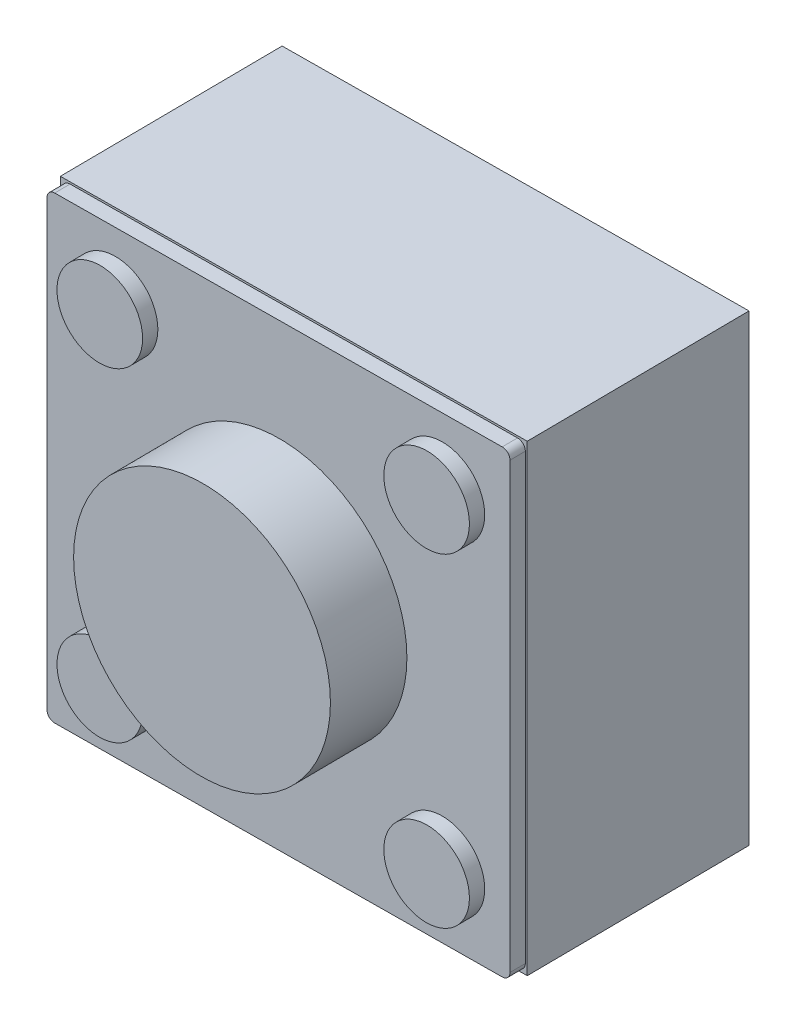
ISO-10303-21;
HEADER;
FILE_DESCRIPTION(('STEP AP214'),'2;1');
FILE_NAME('part.step','',(''),(''),'','','');
FILE_SCHEMA(('AUTOMOTIVE_DESIGN { 1 0 10303 214 1 1 1 1 }'));
ENDSEC;
DATA;
#1=APPLICATION_CONTEXT('core data for automotive mechanical design processes');
#2=APPLICATION_PROTOCOL_DEFINITION('international standard','automotive_design',2000,#1);
#3=PRODUCT_CONTEXT('',#1,'mechanical');
#4=PRODUCT('Part','Part','',(#3));
#5=PRODUCT_RELATED_PRODUCT_CATEGORY('part','',(#4));
#6=PRODUCT_DEFINITION_FORMATION('','',#4);
#7=PRODUCT_DEFINITION_CONTEXT('part definition',#1,'design');
#8=PRODUCT_DEFINITION('design','',#6,#7);
#9=PRODUCT_DEFINITION_SHAPE('','',#8);
#10=(LENGTH_UNIT() NAMED_UNIT(*) SI_UNIT(.MILLI.,.METRE.));
#11=(NAMED_UNIT(*) PLANE_ANGLE_UNIT() SI_UNIT($,.RADIAN.));
#12=(NAMED_UNIT(*) SI_UNIT($,.STERADIAN.) SOLID_ANGLE_UNIT());
#13=UNCERTAINTY_MEASURE_WITH_UNIT(LENGTH_MEASURE(1.E-05),#10,'distance_accuracy_value','');
#14=(GEOMETRIC_REPRESENTATION_CONTEXT(3) GLOBAL_UNCERTAINTY_ASSIGNED_CONTEXT((#13)) GLOBAL_UNIT_ASSIGNED_CONTEXT((#10,
#11,#12)) REPRESENTATION_CONTEXT('',''));
#15=CARTESIAN_POINT('',(0.,0.,0.));
#16=DIRECTION('',(0.,0.,1.));
#17=DIRECTION('',(1.,0.,0.));
#18=AXIS2_PLACEMENT_3D('',#15,#16,#17);
#19=CARTESIAN_POINT('',(-5.9424691659409,0.,1.82592907771696));
#20=DIRECTION('',(0.999961923064158,0.,-0.00872653549997458));
#21=DIRECTION('',(0.,-1.,0.));
#22=AXIS2_PLACEMENT_3D('',#19,#20,#21);
#23=PLANE('',#22);
#24=DIRECTION('',(0.,1.,0.));
#25=VECTOR('',#24,1.);
#26=CARTESIAN_POINT('',(-5.9424691659409,0.,1.82592907771696));
#27=LINE('',#26,#25);
#28=CARTESIAN_POINT('',(-5.9424691659409,-5.85,1.82592907771696));
#29=VERTEX_POINT('',#28);
#30=CARTESIAN_POINT('',(-5.9424691659409,-0.1,1.82592907771696));
#31=VERTEX_POINT('',#30);
#32=EDGE_CURVE('E170',#29,#31,#27,.T.);
#33=ORIENTED_EDGE('',*,*,#32,.F.);
#34=DIRECTION('',(0.00872653549997458,0.,0.999961923064158));
#35=VECTOR('',#34,1.);
#36=CARTESIAN_POINT('',(-5.9424691659409,-5.85,1.82592907771696));
#37=LINE('',#36,#35);
#38=CARTESIAN_POINT('',(-5.94072385884091,-5.85,2.0259214623298));
#39=VERTEX_POINT('',#38);
#40=EDGE_CURVE('E223',#29,#39,#37,.T.);
#41=ORIENTED_EDGE('',*,*,#40,.T.);
#42=DIRECTION('',(0.,1.,0.));
#43=VECTOR('',#42,1.);
#44=CARTESIAN_POINT('',(-5.94072385884091,0.,2.0259214623298));
#45=LINE('',#44,#43);
#46=CARTESIAN_POINT('',(-5.94072385884091,-0.1,2.0259214623298));
#47=VERTEX_POINT('',#46);
#48=EDGE_CURVE('E159',#39,#47,#45,.T.);
#49=ORIENTED_EDGE('',*,*,#48,.T.);
#50=DIRECTION('',(0.00872653549997458,0.,0.999961923064158));
#51=VECTOR('',#50,1.);
#52=CARTESIAN_POINT('',(-5.9424691659409,-0.1,1.82592907771696));
#53=LINE('',#52,#51);
#54=EDGE_CURVE('E220',#47,#31,#53,.F.);
#55=ORIENTED_EDGE('',*,*,#54,.T.);
#56=EDGE_LOOP('',(#33,#41,#49,#55));
#57=FACE_BOUND('',#56,.T.);
#58=ADVANCED_FACE('F38',(#57),#23,.F.);
#59=CARTESIAN_POINT('',(-5.9424691659409,0.,1.82592907771696));
#60=DIRECTION('',(0.,-1.,0.));
#61=DIRECTION('',(-0.999961923064158,0.,0.00872653549997458));
#62=AXIS2_PLACEMENT_3D('',#59,#60,#61);
#63=PLANE('',#62);
#64=DIRECTION('',(0.999961923064158,0.,-0.00872653549997458));
#65=VECTOR('',#64,1.);
#66=CARTESIAN_POINT('',(-5.9424691659409,0.,1.82592907771696));
#67=LINE('',#66,#65);
#68=CARTESIAN_POINT('',(-5.84247297363449,0.,1.82505642416697));
#69=VERTEX_POINT('',#68);
#70=CARTESIAN_POINT('',(-0.0926919160155809,0.,1.77487884504211));
#71=VERTEX_POINT('',#70);
#72=EDGE_CURVE('E173',#69,#71,#67,.T.);
#73=ORIENTED_EDGE('',*,*,#72,.F.);
#74=DIRECTION('',(0.00872653549997458,0.,0.999961923064158));
#75=VECTOR('',#74,1.);
#76=CARTESIAN_POINT('',(-5.84247297363449,0.,1.82505642416697));
#77=LINE('',#76,#75);
#78=CARTESIAN_POINT('',(-5.84072766653449,0.,2.0250488087798));
#79=VERTEX_POINT('',#78);
#80=EDGE_CURVE('E229',#69,#79,#77,.T.);
#81=ORIENTED_EDGE('',*,*,#80,.T.);
#82=DIRECTION('',(0.999961923064158,0.,-0.00872653549997458));
#83=VECTOR('',#82,1.);
#84=CARTESIAN_POINT('',(-5.94072385884091,0.,2.0259214623298));
#85=LINE('',#84,#83);
#86=CARTESIAN_POINT('',(-0.0909466089155852,0.,1.97487122965495));
#87=VERTEX_POINT('',#86);
#88=EDGE_CURVE('E164',#79,#87,#85,.T.);
#89=ORIENTED_EDGE('',*,*,#88,.T.);
#90=DIRECTION('',(0.00872653549997458,0.,0.999961923064158));
#91=VECTOR('',#90,1.);
#92=CARTESIAN_POINT('',(-0.0926919160155809,0.,1.77487884504211));
#93=LINE('',#92,#91);
#94=EDGE_CURVE('E55',#87,#71,#93,.F.);
#95=ORIENTED_EDGE('',*,*,#94,.T.);
#96=EDGE_LOOP('',(#73,#81,#89,#95));
#97=FACE_BOUND('',#96,.T.);
#98=ADVANCED_FACE('F254',(#97),#63,.F.);
#99=CARTESIAN_POINT('',(0.00730427629083447,0.,1.77400619149212));
#100=DIRECTION('',(-0.999961923064158,0.,0.00872653549997458));
#101=DIRECTION('',(0.,1.,0.));
#102=AXIS2_PLACEMENT_3D('',#99,#100,#101);
#103=PLANE('',#102);
#104=DIRECTION('',(0.,-1.,0.));
#105=VECTOR('',#104,1.);
#106=CARTESIAN_POINT('',(0.00904958339083013,0.,1.97399857610495));
#107=LINE('',#106,#105);
#108=CARTESIAN_POINT('',(0.00904958339083013,-0.100000000000001,1.97399857610495));
#109=VERTEX_POINT('',#108);
#110=CARTESIAN_POINT('',(0.00904958339082926,-5.85,1.97399857610495));
#111=VERTEX_POINT('',#110);
#112=EDGE_CURVE('E188',#109,#111,#107,.T.);
#113=ORIENTED_EDGE('',*,*,#112,.T.);
#114=DIRECTION('',(0.00872653549997458,0.,0.999961923064158));
#115=VECTOR('',#114,1.);
#116=CARTESIAN_POINT('',(0.00730427629083361,-5.85,1.77400619149212));
#117=LINE('',#116,#115);
#118=CARTESIAN_POINT('',(0.00730427629083361,-5.85,1.77400619149212));
#119=VERTEX_POINT('',#118);
#120=EDGE_CURVE('E217',#111,#119,#117,.F.);
#121=ORIENTED_EDGE('',*,*,#120,.T.);
#122=DIRECTION('',(0.,-1.,0.));
#123=VECTOR('',#122,1.);
#124=CARTESIAN_POINT('',(0.00730427629083447,0.,1.77400619149212));
#125=LINE('',#124,#123);
#126=CARTESIAN_POINT('',(0.00730427629083447,-0.100000000000001,1.77400619149212));
#127=VERTEX_POINT('',#126);
#128=EDGE_CURVE('E177',#127,#119,#125,.T.);
#129=ORIENTED_EDGE('',*,*,#128,.F.);
#130=DIRECTION('',(0.00872653549997458,0.,0.999961923064158));
#131=VECTOR('',#130,1.);
#132=CARTESIAN_POINT('',(0.00730427629083447,-0.100000000000001,1.77400619149212));
#133=LINE('',#132,#131);
#134=EDGE_CURVE('E213',#127,#109,#133,.T.);
#135=ORIENTED_EDGE('',*,*,#134,.T.);
#136=EDGE_LOOP('',(#113,#121,#129,#135));
#137=FACE_BOUND('',#136,.T.);
#138=ADVANCED_FACE('F247',(#137),#103,.F.);
#139=CARTESIAN_POINT('',(-5.9424691659409,-5.95,1.82592907771696));
#140=DIRECTION('',(0.,1.,0.));
#141=DIRECTION('',(0.999961923064158,0.,-0.00872653549997458));
#142=AXIS2_PLACEMENT_3D('',#139,#140,#141);
#143=PLANE('',#142);
#144=DIRECTION('',(-0.999961923064158,0.,0.00872653549997458));
#145=VECTOR('',#144,1.);
#146=CARTESIAN_POINT('',(-5.9424691659409,-5.95,1.82592907771696));
#147=LINE('',#146,#145);
#148=CARTESIAN_POINT('',(-0.0926919160155817,-5.95,1.77487884504211));
#149=VERTEX_POINT('',#148);
#150=CARTESIAN_POINT('',(-5.84247297363449,-5.95,1.82505642416697));
#151=VERTEX_POINT('',#150);
#152=EDGE_CURVE('E181',#149,#151,#147,.T.);
#153=ORIENTED_EDGE('',*,*,#152,.F.);
#154=DIRECTION('',(0.00872653549997458,0.,0.999961923064158));
#155=VECTOR('',#154,1.);
#156=CARTESIAN_POINT('',(-0.0926919160155817,-5.95,1.77487884504211));
#157=LINE('',#156,#155);
#158=CARTESIAN_POINT('',(-0.0909466089155861,-5.95,1.97487122965495));
#159=VERTEX_POINT('',#158);
#160=EDGE_CURVE('E197',#149,#159,#157,.T.);
#161=ORIENTED_EDGE('',*,*,#160,.T.);
#162=DIRECTION('',(-0.999961923064158,0.,0.00872653549997458));
#163=VECTOR('',#162,1.);
#164=CARTESIAN_POINT('',(-5.94072385884091,-5.95,2.0259214623298));
#165=LINE('',#164,#163);
#166=CARTESIAN_POINT('',(-5.84072766653449,-5.95,2.0250488087798));
#167=VERTEX_POINT('',#166);
#168=EDGE_CURVE('E174',#159,#167,#165,.T.);
#169=ORIENTED_EDGE('',*,*,#168,.T.);
#170=DIRECTION('',(0.00872653549997458,0.,0.999961923064158));
#171=VECTOR('',#170,1.);
#172=CARTESIAN_POINT('',(-5.84247297363449,-5.95,1.82505642416697));
#173=LINE('',#172,#171);
#174=EDGE_CURVE('E184',#167,#151,#173,.F.);
#175=ORIENTED_EDGE('',*,*,#174,.T.);
#176=EDGE_LOOP('',(#153,#161,#169,#175));
#177=FACE_BOUND('',#176,.T.);
#178=ADVANCED_FACE('F269',(#177),#143,.F.);
#179=CARTESIAN_POINT('',(-5.94072385884091,0.,2.0259214623298));
#180=DIRECTION('',(0.00872653549997458,0.,0.999961923064158));
#181=DIRECTION('',(0.999961923064158,0.,-0.00872653549997458));
#182=AXIS2_PLACEMENT_3D('',#179,#180,#181);
#183=PLANE('',#182);
#184=CARTESIAN_POINT('',(-5.06575717615977,-0.875000000000001,2.01828574376732));
#185=DIRECTION('',(0.00872653549997458,0.,0.999961923064158));
#186=DIRECTION('',(0.999961923064158,0.,-0.00872653549997458));
#187=AXIS2_PLACEMENT_3D('',#184,#185,#186);
#188=CIRCLE('',#187,0.55);
#189=CARTESIAN_POINT('',(-4.51577811847448,-0.875000000000001,2.01348614924233));
#190=VERTEX_POINT('',#189);
#191=EDGE_CURVE('E356',#190,#190,#188,.T.);
#192=ORIENTED_EDGE('',*,*,#191,.F.);
#193=EDGE_LOOP('',(#192));
#194=FACE_BOUND('',#193,.T.);
#195=CARTESIAN_POINT('',(-5.06575717615977,-5.075,2.01828574376732));
#196=DIRECTION('',(0.00872653549997458,0.,0.999961923064158));
#197=DIRECTION('',(0.999961923064158,0.,-0.00872653549997458));
#198=AXIS2_PLACEMENT_3D('',#195,#196,#197);
#199=CIRCLE('',#198,0.55);
#200=CARTESIAN_POINT('',(-4.51577811847448,-5.075,2.01348614924233));
#201=VERTEX_POINT('',#200);
#202=EDGE_CURVE('E365',#201,#201,#199,.T.);
#203=ORIENTED_EDGE('',*,*,#202,.F.);
#204=EDGE_LOOP('',(#203));
#205=FACE_BOUND('',#204,.T.);
#206=CARTESIAN_POINT('',(-0.865917099290308,-5.075,1.98163429466743));
#207=DIRECTION('',(0.00872653549997458,0.,0.999961923064158));
#208=DIRECTION('',(0.999961923064158,0.,-0.00872653549997458));
#209=AXIS2_PLACEMENT_3D('',#206,#207,#208);
#210=CIRCLE('',#209,0.55);
#211=CARTESIAN_POINT('',(-0.315938041605021,-5.075,1.97683470014244));
#212=VERTEX_POINT('',#211);
#213=EDGE_CURVE('E371',#212,#212,#210,.T.);
#214=ORIENTED_EDGE('',*,*,#213,.F.);
#215=EDGE_LOOP('',(#214));
#216=FACE_BOUND('',#215,.T.);
#217=CARTESIAN_POINT('',(-0.865917099290307,-0.875000000000001,1.98163429466743));
#218=DIRECTION('',(0.00872653549997458,0.,0.999961923064158));
#219=DIRECTION('',(0.999961923064158,0.,-0.00872653549997458));
#220=AXIS2_PLACEMENT_3D('',#217,#218,#219);
#221=CIRCLE('',#220,0.55);
#222=CARTESIAN_POINT('',(-0.31593804160502,-0.875000000000001,1.97683470014244));
#223=VERTEX_POINT('',#222);
#224=EDGE_CURVE('E379',#223,#223,#221,.T.);
#225=ORIENTED_EDGE('',*,*,#224,.F.);
#226=EDGE_LOOP('',(#225));
#227=FACE_BOUND('',#226,.T.);
#228=CARTESIAN_POINT('',(-2.96583713772504,-2.975,1.99996001921737));
#229=DIRECTION('',(0.00872653549997458,0.,0.999961923064158));
#230=DIRECTION('',(0.999961923064158,0.,-0.00872653549997458));
#231=AXIS2_PLACEMENT_3D('',#228,#229,#230);
#232=CIRCLE('',#231,1.65);
#233=CARTESIAN_POINT('',(-1.31589996466918,-2.975,1.98556123564241));
#234=VERTEX_POINT('',#233);
#235=EDGE_CURVE('E11',#234,#234,#232,.T.);
#236=ORIENTED_EDGE('',*,*,#235,.F.);
#237=EDGE_LOOP('',(#236));
#238=FACE_BOUND('',#237,.T.);
#239=ORIENTED_EDGE('',*,*,#168,.F.);
#240=CARTESIAN_POINT('',(-0.0909466089155861,-5.85,1.97487122965495));
#241=DIRECTION('',(0.00872653549997458,0.,0.999961923064158));
#242=DIRECTION('',(0.999961923064158,0.,-0.00872653549997458));
#243=AXIS2_PLACEMENT_3D('',#240,#241,#242);
#244=CIRCLE('',#243,0.1);
#245=EDGE_CURVE('E210',#159,#111,#244,.T.);
#246=ORIENTED_EDGE('',*,*,#245,.T.);
#247=ORIENTED_EDGE('',*,*,#112,.F.);
#248=CARTESIAN_POINT('',(-0.0909466089155852,-0.100000000000001,1.97487122965495));
#249=DIRECTION('',(0.00872653549997458,0.,0.999961923064158));
#250=DIRECTION('',(0.999961923064158,0.,-0.00872653549997458));
#251=AXIS2_PLACEMENT_3D('',#248,#249,#250);
#252=CIRCLE('',#251,0.1);
#253=EDGE_CURVE('E201',#109,#87,#252,.T.);
#254=ORIENTED_EDGE('',*,*,#253,.T.);
#255=ORIENTED_EDGE('',*,*,#88,.F.);
#256=CARTESIAN_POINT('',(-5.84072766653449,-0.1,2.0250488087798));
#257=DIRECTION('',(0.00872653549997458,0.,0.999961923064158));
#258=DIRECTION('',(0.999961923064158,0.,-0.00872653549997458));
#259=AXIS2_PLACEMENT_3D('',#256,#257,#258);
#260=CIRCLE('',#259,0.1);
#261=EDGE_CURVE('E204',#79,#47,#260,.T.);
#262=ORIENTED_EDGE('',*,*,#261,.T.);
#263=ORIENTED_EDGE('',*,*,#48,.F.);
#264=CARTESIAN_POINT('',(-5.84072766653449,-5.85,2.0250488087798));
#265=DIRECTION('',(0.00872653549997458,0.,0.999961923064158));
#266=DIRECTION('',(0.999961923064158,0.,-0.00872653549997458));
#267=AXIS2_PLACEMENT_3D('',#264,#265,#266);
#268=CIRCLE('',#267,0.1);
#269=EDGE_CURVE('E207',#39,#167,#268,.T.);
#270=ORIENTED_EDGE('',*,*,#269,.T.);
#271=EDGE_LOOP('',(#239,#246,#247,#254,#255,#262,#263,#270));
#272=FACE_BOUND('',#271,.T.);
#273=ADVANCED_FACE('F253',(#194,#205,#216,#227,#238,#272),#183,.T.);
#274=CARTESIAN_POINT('',(-5.9424691659409,0.,1.82592907771696));
#275=DIRECTION('',(-0.00872653549997458,0.,-0.999961923064158));
#276=DIRECTION('',(-0.999961923064158,0.,0.00872653549997458));
#277=AXIS2_PLACEMENT_3D('',#274,#275,#276);
#278=PLANE('',#277);
#279=DIRECTION('',(0.,-1.,0.));
#280=VECTOR('',#279,1.);
#281=CARTESIAN_POINT('',(0.0323033243674374,0.,1.77378802810462));
#282=LINE('',#281,#280);
#283=CARTESIAN_POINT('',(0.0323033243674374,0.0249999999999987,1.77378802810462));
#284=VERTEX_POINT('',#283);
#285=CARTESIAN_POINT('',(0.0323033243674374,-5.975,1.77378802810462));
#286=VERTEX_POINT('',#285);
#287=EDGE_CURVE('E157',#284,#286,#282,.T.);
#288=ORIENTED_EDGE('',*,*,#287,.F.);
#289=DIRECTION('',(0.999961923064158,0.,-0.00872653549997458));
#290=VECTOR('',#289,1.);
#291=CARTESIAN_POINT('',(-5.9424691659409,0.0249999999999992,1.82592907771696));
#292=LINE('',#291,#290);
#293=CARTESIAN_POINT('',(-5.96746821401751,0.0249999999999992,1.82614724110446));
#294=VERTEX_POINT('',#293);
#295=EDGE_CURVE('E153',#294,#284,#292,.T.);
#296=ORIENTED_EDGE('',*,*,#295,.F.);
#297=DIRECTION('',(0.,1.,0.));
#298=VECTOR('',#297,1.);
#299=CARTESIAN_POINT('',(-5.96746821401751,0.,1.82614724110446));
#300=LINE('',#299,#298);
#301=CARTESIAN_POINT('',(-5.96746821401751,-5.975,1.82614724110446));
#302=VERTEX_POINT('',#301);
#303=EDGE_CURVE('E400',#302,#294,#300,.T.);
#304=ORIENTED_EDGE('',*,*,#303,.F.);
#305=DIRECTION('',(-0.999961923064158,0.,0.00872653549997458));
#306=VECTOR('',#305,1.);
#307=CARTESIAN_POINT('',(-5.9424691659409,-5.975,1.82592907771696));
#308=LINE('',#307,#306);
#309=EDGE_CURVE('E397',#286,#302,#308,.T.);
#310=ORIENTED_EDGE('',*,*,#309,.F.);
#311=EDGE_LOOP('',(#288,#296,#304,#310));
#312=FACE_BOUND('',#311,.T.);
#313=ORIENTED_EDGE('',*,*,#128,.T.);
#314=CARTESIAN_POINT('',(-0.0926919160155817,-5.85,1.77487884504211));
#315=DIRECTION('',(-0.00872653549997458,0.,-0.999961923064158));
#316=DIRECTION('',(-0.999961923064158,0.,0.00872653549997458));
#317=AXIS2_PLACEMENT_3D('',#314,#315,#316);
#318=CIRCLE('',#317,0.1);
#319=EDGE_CURVE('E233',#119,#149,#318,.T.);
#320=ORIENTED_EDGE('',*,*,#319,.T.);
#321=ORIENTED_EDGE('',*,*,#152,.T.);
#322=CARTESIAN_POINT('',(-5.84247297363449,-5.85,1.82505642416697));
#323=DIRECTION('',(-0.00872653549997458,0.,-0.999961923064158));
#324=DIRECTION('',(-0.999961923064158,0.,0.00872653549997458));
#325=AXIS2_PLACEMENT_3D('',#322,#323,#324);
#326=CIRCLE('',#325,0.1);
#327=EDGE_CURVE('E236',#151,#29,#326,.T.);
#328=ORIENTED_EDGE('',*,*,#327,.T.);
#329=ORIENTED_EDGE('',*,*,#32,.T.);
#330=CARTESIAN_POINT('',(-5.84247297363449,-0.1,1.82505642416697));
#331=DIRECTION('',(-0.00872653549997458,0.,-0.999961923064158));
#332=DIRECTION('',(-0.999961923064158,0.,0.00872653549997458));
#333=AXIS2_PLACEMENT_3D('',#330,#331,#332);
#334=CIRCLE('',#333,0.1);
#335=EDGE_CURVE('E62',#31,#69,#334,.T.);
#336=ORIENTED_EDGE('',*,*,#335,.T.);
#337=ORIENTED_EDGE('',*,*,#72,.T.);
#338=CARTESIAN_POINT('',(-0.0926919160155809,-0.100000000000001,1.77487884504211));
#339=DIRECTION('',(-0.00872653549997458,0.,-0.999961923064158));
#340=DIRECTION('',(-0.999961923064158,0.,0.00872653549997458));
#341=AXIS2_PLACEMENT_3D('',#338,#339,#340);
#342=CIRCLE('',#341,0.1);
#343=EDGE_CURVE('E42',#71,#127,#342,.T.);
#344=ORIENTED_EDGE('',*,*,#343,.T.);
#345=EDGE_LOOP('',(#313,#320,#321,#328,#329,#336,#337,#344));
#346=FACE_BOUND('',#345,.T.);
#347=ADVANCED_FACE('F242',(#312,#346),#278,.F.);
#348=CARTESIAN_POINT('',(0.00699637141751176,0.,-1.12610154878144));
#349=DIRECTION('',(-0.999961923064158,0.,0.00872653549997458));
#350=DIRECTION('',(0.00872653549997458,0.,0.999961923064158));
#351=AXIS2_PLACEMENT_3D('',#348,#349,#350);
#352=PLANE('',#351);
#353=ORIENTED_EDGE('',*,*,#287,.T.);
#354=DIRECTION('',(0.00872653549997458,0.,0.999961923064158));
#355=VECTOR('',#354,1.);
#356=CARTESIAN_POINT('',(0.00699637141751176,-5.975,-1.12610154878144));
#357=LINE('',#356,#355);
#358=CARTESIAN_POINT('',(0.00699637141751176,-5.975,-1.12610154878144));
#359=VERTEX_POINT('',#358);
#360=EDGE_CURVE('E135',#359,#286,#357,.T.);
#361=ORIENTED_EDGE('',*,*,#360,.F.);
#362=DIRECTION('',(0.,-1.,0.));
#363=VECTOR('',#362,1.);
#364=CARTESIAN_POINT('',(0.00699637141751176,0.,-1.12610154878144));
#365=LINE('',#364,#363);
#366=CARTESIAN_POINT('',(0.00699637141751176,0.0249999999999987,-1.12610154878144));
#367=VERTEX_POINT('',#366);
#368=EDGE_CURVE('E143',#367,#359,#365,.T.);
#369=ORIENTED_EDGE('',*,*,#368,.F.);
#370=DIRECTION('',(0.00872653549997458,0.,0.999961923064158));
#371=VECTOR('',#370,1.);
#372=CARTESIAN_POINT('',(0.00699637141751176,0.0249999999999987,-1.12610154878144));
#373=LINE('',#372,#371);
#374=EDGE_CURVE('E394',#367,#284,#373,.T.);
#375=ORIENTED_EDGE('',*,*,#374,.T.);
#376=EDGE_LOOP('',(#353,#361,#369,#375));
#377=FACE_BOUND('',#376,.T.);
#378=ADVANCED_FACE('F155',(#377),#352,.F.);
#379=CARTESIAN_POINT('',(-5.96777611889083,-5.975,-1.07396049916909));
#380=DIRECTION('',(0.,1.,0.));
#381=DIRECTION('',(-0.00872653549997458,0.,-0.999961923064158));
#382=AXIS2_PLACEMENT_3D('',#379,#380,#381);
#383=PLANE('',#382);
#384=ORIENTED_EDGE('',*,*,#309,.T.);
#385=DIRECTION('',(0.00872653549997458,0.,0.999961923064158));
#386=VECTOR('',#385,1.);
#387=CARTESIAN_POINT('',(-5.99277516696743,-5.975,-1.07374233578159));
#388=LINE('',#387,#386);
#389=CARTESIAN_POINT('',(-5.99277516696743,-5.975,-1.07374233578159));
#390=VERTEX_POINT('',#389);
#391=EDGE_CURVE('E138',#390,#302,#388,.T.);
#392=ORIENTED_EDGE('',*,*,#391,.F.);
#393=DIRECTION('',(-0.999961923064158,0.,0.00872653549997458));
#394=VECTOR('',#393,1.);
#395=CARTESIAN_POINT('',(-5.96777611889083,-5.975,-1.07396049916909));
#396=LINE('',#395,#394);
#397=EDGE_CURVE('E131',#359,#390,#396,.T.);
#398=ORIENTED_EDGE('',*,*,#397,.F.);
#399=ORIENTED_EDGE('',*,*,#360,.T.);
#400=EDGE_LOOP('',(#384,#392,#398,#399));
#401=FACE_BOUND('',#400,.T.);
#402=ADVANCED_FACE('F133',(#401),#383,.F.);
#403=CARTESIAN_POINT('',(-5.99277516696743,0.,-1.07374233578159));
#404=DIRECTION('',(0.999961923064158,0.,-0.00872653549997458));
#405=DIRECTION('',(-0.00872653549997458,0.,-0.999961923064158));
#406=AXIS2_PLACEMENT_3D('',#403,#404,#405);
#407=PLANE('',#406);
#408=ORIENTED_EDGE('',*,*,#303,.T.);
#409=DIRECTION('',(0.00872653549997458,0.,0.999961923064158));
#410=VECTOR('',#409,1.);
#411=CARTESIAN_POINT('',(-5.99277516696743,0.0249999999999992,-1.07374233578159));
#412=LINE('',#411,#410);
#413=CARTESIAN_POINT('',(-5.99277516696743,0.0249999999999992,-1.07374233578159));
#414=VERTEX_POINT('',#413);
#415=EDGE_CURVE('E166',#414,#294,#412,.T.);
#416=ORIENTED_EDGE('',*,*,#415,.F.);
#417=DIRECTION('',(0.,1.,0.));
#418=VECTOR('',#417,1.);
#419=CARTESIAN_POINT('',(-5.99277516696743,0.,-1.07374233578159));
#420=LINE('',#419,#418);
#421=EDGE_CURVE('E142',#390,#414,#420,.T.);
#422=ORIENTED_EDGE('',*,*,#421,.F.);
#423=ORIENTED_EDGE('',*,*,#391,.T.);
#424=EDGE_LOOP('',(#408,#416,#422,#423));
#425=FACE_BOUND('',#424,.T.);
#426=ADVANCED_FACE('F300',(#425),#407,.F.);
#427=CARTESIAN_POINT('',(-5.96777611889083,0.0249999999999992,-1.07396049916909));
#428=DIRECTION('',(0.,-1.,0.));
#429=DIRECTION('',(-0.999961923064158,0.,0.00872653549997458));
#430=AXIS2_PLACEMENT_3D('',#427,#428,#429);
#431=PLANE('',#430);
#432=ORIENTED_EDGE('',*,*,#295,.T.);
#433=ORIENTED_EDGE('',*,*,#374,.F.);
#434=DIRECTION('',(0.999961923064158,0.,-0.00872653549997458));
#435=VECTOR('',#434,1.);
#436=CARTESIAN_POINT('',(-5.96777611889083,0.0249999999999992,-1.07396049916909));
#437=LINE('',#436,#435);
#438=EDGE_CURVE('E148',#414,#367,#437,.T.);
#439=ORIENTED_EDGE('',*,*,#438,.F.);
#440=ORIENTED_EDGE('',*,*,#415,.T.);
#441=EDGE_LOOP('',(#432,#433,#439,#440));
#442=FACE_BOUND('',#441,.T.);
#443=ADVANCED_FACE('F280',(#442),#431,.F.);
#444=CARTESIAN_POINT('',(-5.96777611889083,0.,-1.07396049916909));
#445=DIRECTION('',(-0.00872653549997458,0.,-0.999961923064158));
#446=DIRECTION('',(-0.999961923064158,0.,0.00872653549997458));
#447=AXIS2_PLACEMENT_3D('',#444,#445,#446);
#448=PLANE('',#447);
#449=ORIENTED_EDGE('',*,*,#368,.T.);
#450=ORIENTED_EDGE('',*,*,#397,.T.);
#451=ORIENTED_EDGE('',*,*,#421,.T.);
#452=ORIENTED_EDGE('',*,*,#438,.T.);
#453=EDGE_LOOP('',(#449,#450,#451,#452));
#454=FACE_BOUND('',#453,.T.);
#455=ADVANCED_FACE('F146',(#454),#448,.T.);
#456=CARTESIAN_POINT('',(-0.0926919160155817,-5.85,1.77487884504211));
#457=DIRECTION('',(0.00872653549997458,0.,0.999961923064158));
#458=DIRECTION('',(0.999961923064158,0.,-0.00872653549997458));
#459=AXIS2_PLACEMENT_3D('',#456,#457,#458);
#460=CYLINDRICAL_SURFACE('',#459,0.1);
#461=ORIENTED_EDGE('',*,*,#319,.F.);
#462=ORIENTED_EDGE('',*,*,#120,.F.);
#463=ORIENTED_EDGE('',*,*,#245,.F.);
#464=ORIENTED_EDGE('',*,*,#160,.F.);
#465=EDGE_LOOP('',(#461,#462,#463,#464));
#466=FACE_BOUND('',#465,.T.);
#467=ADVANCED_FACE('F272',(#466),#460,.T.);
#468=CARTESIAN_POINT('',(-5.84247297363449,-5.85,1.82505642416697));
#469=DIRECTION('',(0.00872653549997458,0.,0.999961923064158));
#470=DIRECTION('',(0.999961923064158,0.,-0.00872653549997458));
#471=AXIS2_PLACEMENT_3D('',#468,#469,#470);
#472=CYLINDRICAL_SURFACE('',#471,0.1);
#473=ORIENTED_EDGE('',*,*,#327,.F.);
#474=ORIENTED_EDGE('',*,*,#174,.F.);
#475=ORIENTED_EDGE('',*,*,#269,.F.);
#476=ORIENTED_EDGE('',*,*,#40,.F.);
#477=EDGE_LOOP('',(#473,#474,#475,#476));
#478=FACE_BOUND('',#477,.T.);
#479=ADVANCED_FACE('F265',(#478),#472,.T.);
#480=CARTESIAN_POINT('',(-5.84247297363449,-0.1,1.82505642416697));
#481=DIRECTION('',(0.00872653549997458,0.,0.999961923064158));
#482=DIRECTION('',(0.999961923064158,0.,-0.00872653549997458));
#483=AXIS2_PLACEMENT_3D('',#480,#481,#482);
#484=CYLINDRICAL_SURFACE('',#483,0.1);
#485=ORIENTED_EDGE('',*,*,#335,.F.);
#486=ORIENTED_EDGE('',*,*,#54,.F.);
#487=ORIENTED_EDGE('',*,*,#261,.F.);
#488=ORIENTED_EDGE('',*,*,#80,.F.);
#489=EDGE_LOOP('',(#485,#486,#487,#488));
#490=FACE_BOUND('',#489,.T.);
#491=ADVANCED_FACE('F257',(#490),#484,.T.);
#492=CARTESIAN_POINT('',(-0.0926919160155809,-0.100000000000001,1.77487884504211));
#493=DIRECTION('',(0.00872653549997458,0.,0.999961923064158));
#494=DIRECTION('',(0.999961923064158,0.,-0.00872653549997458));
#495=AXIS2_PLACEMENT_3D('',#492,#493,#494);
#496=CYLINDRICAL_SURFACE('',#495,0.1);
#497=ORIENTED_EDGE('',*,*,#343,.F.);
#498=ORIENTED_EDGE('',*,*,#94,.F.);
#499=ORIENTED_EDGE('',*,*,#253,.F.);
#500=ORIENTED_EDGE('',*,*,#134,.F.);
#501=EDGE_LOOP('',(#497,#498,#499,#500));
#502=FACE_BOUND('',#501,.T.);
#503=ADVANCED_FACE('F40',(#502),#496,.T.);
#504=CARTESIAN_POINT('',(-2.96409183062504,-2.975,2.1999524038302));
#505=DIRECTION('',(-0.00872653549997458,0.,-0.999961923064158));
#506=DIRECTION('',(-0.999961923064158,0.,0.00872653549997458));
#507=AXIS2_PLACEMENT_3D('',#504,#505,#506);
#508=CYLINDRICAL_SURFACE('',#507,1.65);
#509=ORIENTED_EDGE('',*,*,#235,.T.);
#510=EDGE_LOOP('',(#509));
#511=FACE_BOUND('',#510,.T.);
#512=CARTESIAN_POINT('',(-2.95711060222506,-2.975,2.99992194228153));
#513=DIRECTION('',(0.00872653549997458,0.,0.999961923064158));
#514=DIRECTION('',(0.999961923064158,0.,-0.00872653549997458));
#515=AXIS2_PLACEMENT_3D('',#512,#513,#514);
#516=CIRCLE('',#515,1.65);
#517=CARTESIAN_POINT('',(-1.3071734291692,-2.975,2.98552315870657));
#518=VERTEX_POINT('',#517);
#519=EDGE_CURVE('E353',#518,#518,#516,.T.);
#520=ORIENTED_EDGE('',*,*,#519,.F.);
#521=EDGE_LOOP('',(#520));
#522=FACE_BOUND('',#521,.T.);
#523=ADVANCED_FACE('F310',(#511,#522),#508,.T.);
#524=CARTESIAN_POINT('',(-0.864171792190312,-0.875000000000001,2.18162667928026));
#525=DIRECTION('',(-0.00872653549997458,0.,-0.999961923064158));
#526=DIRECTION('',(-0.999961923064158,0.,0.00872653549997458));
#527=AXIS2_PLACEMENT_3D('',#524,#525,#526);
#528=CYLINDRICAL_SURFACE('',#527,0.55);
#529=CARTESIAN_POINT('',(-0.864171792190312,-0.875000000000001,2.18162667928026));
#530=DIRECTION('',(0.00872653549997458,0.,0.999961923064158));
#531=DIRECTION('',(0.999961923064158,0.,-0.00872653549997458));
#532=AXIS2_PLACEMENT_3D('',#529,#530,#531);
#533=CIRCLE('',#532,0.55);
#534=CARTESIAN_POINT('',(-0.314192734505025,-0.875000000000001,2.17682708475527));
#535=VERTEX_POINT('',#534);
#536=EDGE_CURVE('E383',#535,#535,#533,.T.);
#537=ORIENTED_EDGE('',*,*,#536,.F.);
#538=EDGE_LOOP('',(#537));
#539=FACE_BOUND('',#538,.T.);
#540=ORIENTED_EDGE('',*,*,#224,.T.);
#541=EDGE_LOOP('',(#540));
#542=FACE_BOUND('',#541,.T.);
#543=ADVANCED_FACE('F313',(#539,#542),#528,.T.);
#544=CARTESIAN_POINT('',(-0.864171792190312,-0.875000000000001,2.18162667928026));
#545=DIRECTION('',(0.00872653549997458,0.,0.999961923064158));
#546=DIRECTION('',(0.999961923064158,0.,-0.00872653549997458));
#547=AXIS2_PLACEMENT_3D('',#544,#545,#546);
#548=PLANE('',#547);
#549=ORIENTED_EDGE('',*,*,#536,.T.);
#550=EDGE_LOOP('',(#549));
#551=FACE_BOUND('',#550,.T.);
#552=ADVANCED_FACE('F317',(#551),#548,.T.);
#553=CARTESIAN_POINT('',(-0.864171792190313,-5.075,2.18162667928026));
#554=DIRECTION('',(-0.00872653549997458,0.,-0.999961923064158));
#555=DIRECTION('',(-0.999961923064158,0.,0.00872653549997458));
#556=AXIS2_PLACEMENT_3D('',#553,#554,#555);
#557=CYLINDRICAL_SURFACE('',#556,0.55);
#558=CARTESIAN_POINT('',(-0.864171792190313,-5.075,2.18162667928026));
#559=DIRECTION('',(0.00872653549997458,0.,0.999961923064158));
#560=DIRECTION('',(0.999961923064158,0.,-0.00872653549997458));
#561=AXIS2_PLACEMENT_3D('',#558,#559,#560);
#562=CIRCLE('',#561,0.55);
#563=CARTESIAN_POINT('',(-0.314192734505026,-5.075,2.17682708475527));
#564=VERTEX_POINT('',#563);
#565=EDGE_CURVE('E375',#564,#564,#562,.T.);
#566=ORIENTED_EDGE('',*,*,#565,.F.);
#567=EDGE_LOOP('',(#566));
#568=FACE_BOUND('',#567,.T.);
#569=ORIENTED_EDGE('',*,*,#213,.T.);
#570=EDGE_LOOP('',(#569));
#571=FACE_BOUND('',#570,.T.);
#572=ADVANCED_FACE('F321',(#568,#571),#557,.T.);
#573=CARTESIAN_POINT('',(-0.864171792190313,-5.075,2.18162667928026));
#574=DIRECTION('',(0.00872653549997458,0.,0.999961923064158));
#575=DIRECTION('',(0.999961923064158,0.,-0.00872653549997458));
#576=AXIS2_PLACEMENT_3D('',#573,#574,#575);
#577=PLANE('',#576);
#578=ORIENTED_EDGE('',*,*,#565,.T.);
#579=EDGE_LOOP('',(#578));
#580=FACE_BOUND('',#579,.T.);
#581=ADVANCED_FACE('F325',(#580),#577,.T.);
#582=CARTESIAN_POINT('',(-5.06401186905978,-5.075,2.21827812838015));
#583=DIRECTION('',(-0.00872653549997458,0.,-0.999961923064158));
#584=DIRECTION('',(-0.999961923064158,0.,0.00872653549997458));
#585=AXIS2_PLACEMENT_3D('',#582,#583,#584);
#586=CYLINDRICAL_SURFACE('',#585,0.55);
#587=CARTESIAN_POINT('',(-5.06401186905978,-5.075,2.21827812838015));
#588=DIRECTION('',(0.00872653549997458,0.,0.999961923064158));
#589=DIRECTION('',(0.999961923064158,0.,-0.00872653549997458));
#590=AXIS2_PLACEMENT_3D('',#587,#588,#589);
#591=CIRCLE('',#590,0.55);
#592=CARTESIAN_POINT('',(-4.51403281137449,-5.075,2.21347853385516));
#593=VERTEX_POINT('',#592);
#594=EDGE_CURVE('E367',#593,#593,#591,.T.);
#595=ORIENTED_EDGE('',*,*,#594,.F.);
#596=EDGE_LOOP('',(#595));
#597=FACE_BOUND('',#596,.T.);
#598=ORIENTED_EDGE('',*,*,#202,.T.);
#599=EDGE_LOOP('',(#598));
#600=FACE_BOUND('',#599,.T.);
#601=ADVANCED_FACE('F329',(#597,#600),#586,.T.);
#602=CARTESIAN_POINT('',(-5.06401186905978,-5.075,2.21827812838015));
#603=DIRECTION('',(0.00872653549997458,0.,0.999961923064158));
#604=DIRECTION('',(0.999961923064158,0.,-0.00872653549997458));
#605=AXIS2_PLACEMENT_3D('',#602,#603,#604);
#606=PLANE('',#605);
#607=ORIENTED_EDGE('',*,*,#594,.T.);
#608=EDGE_LOOP('',(#607));
#609=FACE_BOUND('',#608,.T.);
#610=ADVANCED_FACE('F333',(#609),#606,.T.);
#611=CARTESIAN_POINT('',(-5.06401186905978,-0.875000000000001,2.21827812838015));
#612=DIRECTION('',(-0.00872653549997458,0.,-0.999961923064158));
#613=DIRECTION('',(-0.999961923064158,0.,0.00872653549997458));
#614=AXIS2_PLACEMENT_3D('',#611,#612,#613);
#615=CYLINDRICAL_SURFACE('',#614,0.55);
#616=CARTESIAN_POINT('',(-5.06401186905978,-0.875000000000001,2.21827812838015));
#617=DIRECTION('',(0.00872653549997458,0.,0.999961923064158));
#618=DIRECTION('',(0.999961923064158,0.,-0.00872653549997458));
#619=AXIS2_PLACEMENT_3D('',#616,#617,#618);
#620=CIRCLE('',#619,0.55);
#621=CARTESIAN_POINT('',(-4.51403281137449,-0.875000000000001,2.21347853385516));
#622=VERTEX_POINT('',#621);
#623=EDGE_CURVE('E360',#622,#622,#620,.T.);
#624=ORIENTED_EDGE('',*,*,#623,.F.);
#625=EDGE_LOOP('',(#624));
#626=FACE_BOUND('',#625,.T.);
#627=ORIENTED_EDGE('',*,*,#191,.T.);
#628=EDGE_LOOP('',(#627));
#629=FACE_BOUND('',#628,.T.);
#630=ADVANCED_FACE('F337',(#626,#629),#615,.T.);
#631=CARTESIAN_POINT('',(-5.06401186905978,-0.875000000000001,2.21827812838015));
#632=DIRECTION('',(0.00872653549997458,0.,0.999961923064158));
#633=DIRECTION('',(0.999961923064158,0.,-0.00872653549997458));
#634=AXIS2_PLACEMENT_3D('',#631,#632,#633);
#635=PLANE('',#634);
#636=ORIENTED_EDGE('',*,*,#623,.T.);
#637=EDGE_LOOP('',(#636));
#638=FACE_BOUND('',#637,.T.);
#639=ADVANCED_FACE('F341',(#638),#635,.T.);
#640=CARTESIAN_POINT('',(-2.95711060222506,-2.975,2.99992194228153));
#641=DIRECTION('',(0.00872653549997458,0.,0.999961923064158));
#642=DIRECTION('',(0.999961923064158,0.,-0.00872653549997458));
#643=AXIS2_PLACEMENT_3D('',#640,#641,#642);
#644=PLANE('',#643);
#645=ORIENTED_EDGE('',*,*,#519,.T.);
#646=EDGE_LOOP('',(#645));
#647=FACE_BOUND('',#646,.T.);
#648=ADVANCED_FACE('F345',(#647),#644,.T.);
#649=CLOSED_SHELL('',(#58,#98,#138,#178,#273,#347,#378,#402,#426,#443,#455,#467,#479,#491,#503,
#523,#543,#552,#572,#581,#601,#610,#630,#639,#648));
#650=MANIFOLD_SOLID_BREP('B2',#649);
#651=ADVANCED_BREP_SHAPE_REPRESENTATION('',(#18,#650),#14);
#652=SHAPE_DEFINITION_REPRESENTATION(#9,#651);
ENDSEC;
END-ISO-10303-21;
